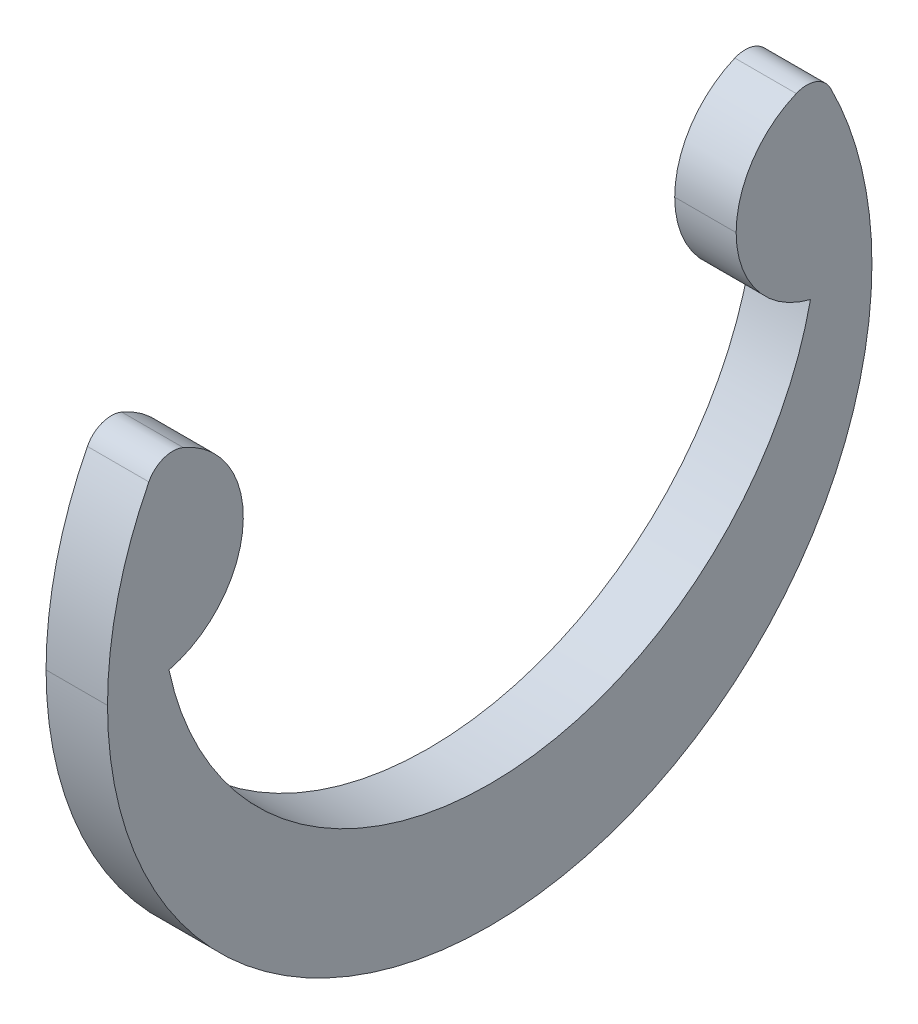
ISO-10303-21;
HEADER;
FILE_DESCRIPTION(('STEP AP214'),'2;1');
FILE_NAME('part.step','',(''),(''),'','','');
FILE_SCHEMA(('AUTOMOTIVE_DESIGN { 1 0 10303 214 1 1 1 1 }'));
ENDSEC;
DATA;
#1=APPLICATION_CONTEXT('core data for automotive mechanical design processes');
#2=APPLICATION_PROTOCOL_DEFINITION('international standard','automotive_design',2000,#1);
#3=PRODUCT_CONTEXT('',#1,'mechanical');
#4=PRODUCT('Part','Part','',(#3));
#5=PRODUCT_RELATED_PRODUCT_CATEGORY('part','',(#4));
#6=PRODUCT_DEFINITION_FORMATION('','',#4);
#7=PRODUCT_DEFINITION_CONTEXT('part definition',#1,'design');
#8=PRODUCT_DEFINITION('design','',#6,#7);
#9=PRODUCT_DEFINITION_SHAPE('','',#8);
#10=(LENGTH_UNIT() NAMED_UNIT(*) SI_UNIT(.MILLI.,.METRE.));
#11=(NAMED_UNIT(*) PLANE_ANGLE_UNIT() SI_UNIT($,.RADIAN.));
#12=(NAMED_UNIT(*) SI_UNIT($,.STERADIAN.) SOLID_ANGLE_UNIT());
#13=UNCERTAINTY_MEASURE_WITH_UNIT(LENGTH_MEASURE(1.E-05),#10,'distance_accuracy_value','');
#14=(GEOMETRIC_REPRESENTATION_CONTEXT(3) GLOBAL_UNCERTAINTY_ASSIGNED_CONTEXT((#13)) GLOBAL_UNIT_ASSIGNED_CONTEXT((#10,
#11,#12)) REPRESENTATION_CONTEXT('',''));
#15=CARTESIAN_POINT('',(0.,0.,0.));
#16=DIRECTION('',(0.,0.,1.));
#17=DIRECTION('',(1.,0.,0.));
#18=AXIS2_PLACEMENT_3D('',#15,#16,#17);
#19=CARTESIAN_POINT('',(0.3175,0.982787689221727,-3.55926968931105));
#20=DIRECTION('',(-1.,0.,0.));
#21=DIRECTION('',(0.,0.,1.));
#22=AXIS2_PLACEMENT_3D('',#19,#20,#21);
#23=CYLINDRICAL_SURFACE('',#22,1.01276155881603);
#24=CARTESIAN_POINT('',(0.3175,0.982787689221727,-3.55926968931105));
#25=DIRECTION('',(1.,0.,0.));
#26=DIRECTION('',(0.,0.,1.));
#27=AXIS2_PLACEMENT_3D('',#24,#25,#26);
#28=CIRCLE('',#27,1.01276155881603);
#29=CARTESIAN_POINT('',(0.3175,0.982787689221727,-2.54650813049501));
#30=VERTEX_POINT('',#29);
#31=CARTESIAN_POINT('',(0.3175,0.,-3.3147));
#32=VERTEX_POINT('',#31);
#33=EDGE_CURVE('E41',#30,#32,#28,.T.);
#34=ORIENTED_EDGE('',*,*,#33,.F.);
#35=DIRECTION('',(-1.,0.,0.));
#36=VECTOR('',#35,1.);
#37=CARTESIAN_POINT('',(0.3175,0.982787689221727,-2.54650813049501));
#38=LINE('',#37,#36);
#39=CARTESIAN_POINT('',(-0.3175,0.982787689221727,-2.54650813049501));
#40=VERTEX_POINT('',#39);
#41=EDGE_CURVE('E11',#30,#40,#38,.T.);
#42=ORIENTED_EDGE('',*,*,#41,.T.);
#43=CARTESIAN_POINT('',(-0.3175,0.982787689221727,-3.55926968931105));
#44=DIRECTION('',(1.,0.,0.));
#45=DIRECTION('',(0.,0.,1.));
#46=AXIS2_PLACEMENT_3D('',#43,#44,#45);
#47=CIRCLE('',#46,1.01276155881603);
#48=CARTESIAN_POINT('',(-0.3175,0.,-3.3147));
#49=VERTEX_POINT('',#48);
#50=EDGE_CURVE('E27',#40,#49,#47,.T.);
#51=ORIENTED_EDGE('',*,*,#50,.T.);
#52=DIRECTION('',(-1.,0.,0.));
#53=VECTOR('',#52,1.);
#54=CARTESIAN_POINT('',(0.3175,0.,-3.3147));
#55=LINE('',#54,#53);
#56=EDGE_CURVE('E143',#32,#49,#55,.T.);
#57=ORIENTED_EDGE('',*,*,#56,.F.);
#58=EDGE_LOOP('',(#34,#42,#51,#57));
#59=FACE_BOUND('',#58,.T.);
#60=ADVANCED_FACE('F16',(#59),#23,.T.);
#61=CARTESIAN_POINT('',(0.3175,0.,0.));
#62=DIRECTION('',(-1.,0.,0.));
#63=DIRECTION('',(0.,0.,1.));
#64=AXIS2_PLACEMENT_3D('',#61,#62,#63);
#65=CYLINDRICAL_SURFACE('',#64,3.9497);
#66=CARTESIAN_POINT('',(0.3175,0.,0.));
#67=DIRECTION('',(1.,0.,0.));
#68=DIRECTION('',(0.,0.,1.));
#69=AXIS2_PLACEMENT_3D('',#66,#67,#68);
#70=CIRCLE('',#69,3.9497);
#71=CARTESIAN_POINT('',(0.3175,0.,-3.9497));
#72=VERTEX_POINT('',#71);
#73=CARTESIAN_POINT('',(0.3175,1.78646666666667,-3.52259377999918));
#74=VERTEX_POINT('',#73);
#75=EDGE_CURVE('E188',#72,#74,#70,.T.);
#76=ORIENTED_EDGE('',*,*,#75,.F.);
#77=DIRECTION('',(-1.,0.,0.));
#78=VECTOR('',#77,1.);
#79=CARTESIAN_POINT('',(0.3175,0.,-3.9497));
#80=LINE('',#79,#78);
#81=CARTESIAN_POINT('',(-0.3175,0.,-3.9497));
#82=VERTEX_POINT('',#81);
#83=EDGE_CURVE('E180',#72,#82,#80,.T.);
#84=ORIENTED_EDGE('',*,*,#83,.T.);
#85=CARTESIAN_POINT('',(-0.3175,0.,0.));
#86=DIRECTION('',(1.,0.,0.));
#87=DIRECTION('',(0.,0.,1.));
#88=AXIS2_PLACEMENT_3D('',#85,#86,#87);
#89=CIRCLE('',#88,3.9497);
#90=CARTESIAN_POINT('',(-0.3175,1.78646666666667,-3.52259377999918));
#91=VERTEX_POINT('',#90);
#92=EDGE_CURVE('E103',#82,#91,#89,.T.);
#93=ORIENTED_EDGE('',*,*,#92,.T.);
#94=DIRECTION('',(-1.,0.,0.));
#95=VECTOR('',#94,1.);
#96=CARTESIAN_POINT('',(0.3175,1.78646666666667,-3.52259377999918));
#97=LINE('',#96,#95);
#98=EDGE_CURVE('E91',#74,#91,#97,.T.);
#99=ORIENTED_EDGE('',*,*,#98,.F.);
#100=EDGE_LOOP('',(#76,#84,#93,#99));
#101=FACE_BOUND('',#100,.T.);
#102=ADVANCED_FACE('F246',(#101),#65,.T.);
#103=CARTESIAN_POINT('',(0.3175,0.,0.));
#104=DIRECTION('',(-1.,0.,0.));
#105=DIRECTION('',(0.,0.,1.));
#106=AXIS2_PLACEMENT_3D('',#103,#104,#105);
#107=CYLINDRICAL_SURFACE('',#106,3.9497);
#108=ORIENTED_EDGE('',*,*,#83,.F.);
#109=CARTESIAN_POINT('',(0.3175,0.,0.));
#110=DIRECTION('',(1.,0.,0.));
#111=DIRECTION('',(0.,0.,1.));
#112=AXIS2_PLACEMENT_3D('',#109,#110,#111);
#113=CIRCLE('',#112,3.9497);
#114=CARTESIAN_POINT('',(0.3175,0.,3.9497));
#115=VERTEX_POINT('',#114);
#116=EDGE_CURVE('E233',#115,#72,#113,.T.);
#117=ORIENTED_EDGE('',*,*,#116,.F.);
#118=DIRECTION('',(-1.,0.,0.));
#119=VECTOR('',#118,1.);
#120=CARTESIAN_POINT('',(0.3175,0.,3.9497));
#121=LINE('',#120,#119);
#122=CARTESIAN_POINT('',(-0.3175,0.,3.9497));
#123=VERTEX_POINT('',#122);
#124=EDGE_CURVE('E171',#115,#123,#121,.T.);
#125=ORIENTED_EDGE('',*,*,#124,.T.);
#126=CARTESIAN_POINT('',(-0.3175,0.,0.));
#127=DIRECTION('',(1.,0.,0.));
#128=DIRECTION('',(0.,0.,1.));
#129=AXIS2_PLACEMENT_3D('',#126,#127,#128);
#130=CIRCLE('',#129,3.9497);
#131=EDGE_CURVE('E114',#123,#82,#130,.T.);
#132=ORIENTED_EDGE('',*,*,#131,.T.);
#133=EDGE_LOOP('',(#108,#117,#125,#132));
#134=FACE_BOUND('',#133,.T.);
#135=ADVANCED_FACE('F244',(#134),#107,.T.);
#136=CARTESIAN_POINT('',(0.3175,0.982787689221727,3.55926968931105));
#137=DIRECTION('',(-1.,0.,0.));
#138=DIRECTION('',(0.,0.,1.));
#139=AXIS2_PLACEMENT_3D('',#136,#137,#138);
#140=CYLINDRICAL_SURFACE('',#139,1.01276155881603);
#141=CARTESIAN_POINT('',(-0.3175,0.982787689221727,3.55926968931105));
#142=DIRECTION('',(1.,0.,0.));
#143=DIRECTION('',(0.,0.,1.));
#144=AXIS2_PLACEMENT_3D('',#141,#142,#143);
#145=CIRCLE('',#144,1.01276155881603);
#146=CARTESIAN_POINT('',(-0.3175,0.,3.3147));
#147=VERTEX_POINT('',#146);
#148=CARTESIAN_POINT('',(-0.3175,1.91687954310492,3.16791513967025));
#149=VERTEX_POINT('',#148);
#150=EDGE_CURVE('E153',#147,#149,#145,.T.);
#151=ORIENTED_EDGE('',*,*,#150,.T.);
#152=DIRECTION('',(-1.,0.,0.));
#153=VECTOR('',#152,1.);
#154=CARTESIAN_POINT('',(0.3175,1.91687954310492,3.16791513967025));
#155=LINE('',#154,#153);
#156=CARTESIAN_POINT('',(0.3175,1.91687954310492,3.16791513967025));
#157=VERTEX_POINT('',#156);
#158=EDGE_CURVE('E128',#157,#149,#155,.T.);
#159=ORIENTED_EDGE('',*,*,#158,.F.);
#160=CARTESIAN_POINT('',(0.3175,0.982787689221727,3.55926968931105));
#161=DIRECTION('',(1.,0.,0.));
#162=DIRECTION('',(0.,0.,1.));
#163=AXIS2_PLACEMENT_3D('',#160,#161,#162);
#164=CIRCLE('',#163,1.01276155881603);
#165=CARTESIAN_POINT('',(0.3175,0.,3.3147));
#166=VERTEX_POINT('',#165);
#167=EDGE_CURVE('E135',#166,#157,#164,.T.);
#168=ORIENTED_EDGE('',*,*,#167,.F.);
#169=DIRECTION('',(-1.,0.,0.));
#170=VECTOR('',#169,1.);
#171=CARTESIAN_POINT('',(0.3175,0.,3.3147));
#172=LINE('',#171,#170);
#173=EDGE_CURVE('E138',#166,#147,#172,.T.);
#174=ORIENTED_EDGE('',*,*,#173,.T.);
#175=EDGE_LOOP('',(#151,#159,#168,#174));
#176=FACE_BOUND('',#175,.T.);
#177=ADVANCED_FACE('F137',(#176),#140,.T.);
#178=CARTESIAN_POINT('',(0.3175,1.66096845654136,3.27513368312913));
#179=DIRECTION('',(-1.,0.,0.));
#180=DIRECTION('',(0.,0.,1.));
#181=AXIS2_PLACEMENT_3D('',#178,#179,#180);
#182=CYLINDRICAL_SURFACE('',#181,0.277464052243862);
#183=CARTESIAN_POINT('',(-0.3175,1.66096845654136,3.27513368312913));
#184=DIRECTION('',(1.,0.,0.));
#185=DIRECTION('',(0.,0.,1.));
#186=AXIS2_PLACEMENT_3D('',#183,#184,#185);
#187=CIRCLE('',#186,0.277464052243862);
#188=CARTESIAN_POINT('',(-0.3175,1.78646666666667,3.52259377999918));
#189=VERTEX_POINT('',#188);
#190=EDGE_CURVE('E154',#149,#189,#187,.T.);
#191=ORIENTED_EDGE('',*,*,#190,.T.);
#192=DIRECTION('',(-1.,0.,0.));
#193=VECTOR('',#192,1.);
#194=CARTESIAN_POINT('',(0.3175,1.78646666666667,3.52259377999918));
#195=LINE('',#194,#193);
#196=CARTESIAN_POINT('',(0.3175,1.78646666666667,3.52259377999918));
#197=VERTEX_POINT('',#196);
#198=EDGE_CURVE('E20',#197,#189,#195,.T.);
#199=ORIENTED_EDGE('',*,*,#198,.F.);
#200=CARTESIAN_POINT('',(0.3175,1.66096845654136,3.27513368312913));
#201=DIRECTION('',(1.,0.,0.));
#202=DIRECTION('',(0.,0.,1.));
#203=AXIS2_PLACEMENT_3D('',#200,#201,#202);
#204=CIRCLE('',#203,0.277464052243862);
#205=EDGE_CURVE('E144',#157,#197,#204,.T.);
#206=ORIENTED_EDGE('',*,*,#205,.F.);
#207=ORIENTED_EDGE('',*,*,#158,.T.);
#208=EDGE_LOOP('',(#191,#199,#206,#207));
#209=FACE_BOUND('',#208,.T.);
#210=ADVANCED_FACE('F215',(#209),#182,.T.);
#211=CARTESIAN_POINT('',(0.3175,0.,0.));
#212=DIRECTION('',(-1.,0.,0.));
#213=DIRECTION('',(0.,0.,1.));
#214=AXIS2_PLACEMENT_3D('',#211,#212,#213);
#215=CYLINDRICAL_SURFACE('',#214,3.9497);
#216=ORIENTED_EDGE('',*,*,#124,.F.);
#217=CARTESIAN_POINT('',(0.3175,0.,0.));
#218=DIRECTION('',(1.,0.,0.));
#219=DIRECTION('',(0.,0.,1.));
#220=AXIS2_PLACEMENT_3D('',#217,#218,#219);
#221=CIRCLE('',#220,3.9497);
#222=EDGE_CURVE('E175',#197,#115,#221,.T.);
#223=ORIENTED_EDGE('',*,*,#222,.F.);
#224=ORIENTED_EDGE('',*,*,#198,.T.);
#225=CARTESIAN_POINT('',(-0.3175,0.,0.));
#226=DIRECTION('',(1.,0.,0.));
#227=DIRECTION('',(0.,0.,1.));
#228=AXIS2_PLACEMENT_3D('',#225,#226,#227);
#229=CIRCLE('',#228,3.9497);
#230=EDGE_CURVE('E199',#189,#123,#229,.T.);
#231=ORIENTED_EDGE('',*,*,#230,.T.);
#232=EDGE_LOOP('',(#216,#223,#224,#231));
#233=FACE_BOUND('',#232,.T.);
#234=ADVANCED_FACE('F222',(#233),#215,.T.);
#235=CARTESIAN_POINT('',(0.3175,1.66096845654136,-3.27513368312913));
#236=DIRECTION('',(-1.,0.,0.));
#237=DIRECTION('',(0.,0.,1.));
#238=AXIS2_PLACEMENT_3D('',#235,#236,#237);
#239=CYLINDRICAL_SURFACE('',#238,0.277464052243862);
#240=CARTESIAN_POINT('',(-0.3175,1.66096845654136,-3.27513368312913));
#241=DIRECTION('',(1.,0.,0.));
#242=DIRECTION('',(0.,0.,-1.));
#243=AXIS2_PLACEMENT_3D('',#240,#241,#242);
#244=CIRCLE('',#243,0.277464052243862);
#245=CARTESIAN_POINT('',(-0.3175,1.91687954310492,-3.16791513967025));
#246=VERTEX_POINT('',#245);
#247=EDGE_CURVE('E169',#91,#246,#244,.T.);
#248=ORIENTED_EDGE('',*,*,#247,.T.);
#249=DIRECTION('',(-1.,0.,0.));
#250=VECTOR('',#249,1.);
#251=CARTESIAN_POINT('',(0.3175,1.91687954310492,-3.16791513967025));
#252=LINE('',#251,#250);
#253=CARTESIAN_POINT('',(0.3175,1.91687954310492,-3.16791513967025));
#254=VERTEX_POINT('',#253);
#255=EDGE_CURVE('E182',#254,#246,#252,.T.);
#256=ORIENTED_EDGE('',*,*,#255,.F.);
#257=CARTESIAN_POINT('',(0.3175,1.66096845654136,-3.27513368312913));
#258=DIRECTION('',(1.,0.,0.));
#259=DIRECTION('',(0.,0.,-1.));
#260=AXIS2_PLACEMENT_3D('',#257,#258,#259);
#261=CIRCLE('',#260,0.277464052243862);
#262=EDGE_CURVE('E185',#74,#254,#261,.T.);
#263=ORIENTED_EDGE('',*,*,#262,.F.);
#264=ORIENTED_EDGE('',*,*,#98,.T.);
#265=EDGE_LOOP('',(#248,#256,#263,#264));
#266=FACE_BOUND('',#265,.T.);
#267=ADVANCED_FACE('F248',(#266),#239,.T.);
#268=CARTESIAN_POINT('',(0.3175,0.982787689221727,-3.55926968931105));
#269=DIRECTION('',(-1.,0.,0.));
#270=DIRECTION('',(0.,0.,1.));
#271=AXIS2_PLACEMENT_3D('',#268,#269,#270);
#272=CYLINDRICAL_SURFACE('',#271,1.01276155881603);
#273=ORIENTED_EDGE('',*,*,#41,.F.);
#274=CARTESIAN_POINT('',(0.3175,0.982787689221727,-3.55926968931105));
#275=DIRECTION('',(1.,0.,0.));
#276=DIRECTION('',(0.,0.,1.));
#277=AXIS2_PLACEMENT_3D('',#274,#275,#276);
#278=CIRCLE('',#277,1.01276155881603);
#279=EDGE_CURVE('E165',#254,#30,#278,.T.);
#280=ORIENTED_EDGE('',*,*,#279,.F.);
#281=ORIENTED_EDGE('',*,*,#255,.T.);
#282=CARTESIAN_POINT('',(-0.3175,0.982787689221727,-3.55926968931105));
#283=DIRECTION('',(1.,0.,0.));
#284=DIRECTION('',(0.,0.,1.));
#285=AXIS2_PLACEMENT_3D('',#282,#283,#284);
#286=CIRCLE('',#285,1.01276155881603);
#287=EDGE_CURVE('E178',#246,#40,#286,.T.);
#288=ORIENTED_EDGE('',*,*,#287,.T.);
#289=EDGE_LOOP('',(#273,#280,#281,#288));
#290=FACE_BOUND('',#289,.T.);
#291=ADVANCED_FACE('F251',(#290),#272,.T.);
#292=CARTESIAN_POINT('',(0.3175,0.710236966824645,0.));
#293=DIRECTION('',(-1.,0.,0.));
#294=DIRECTION('',(0.,0.,1.));
#295=AXIS2_PLACEMENT_3D('',#292,#293,#294);
#296=CYLINDRICAL_SURFACE('',#295,3.38993696682465);
#297=CARTESIAN_POINT('',(-0.3175,0.710236966824645,0.));
#298=DIRECTION('',(-1.,0.,0.));
#299=DIRECTION('',(0.,0.,-1.));
#300=AXIS2_PLACEMENT_3D('',#297,#298,#299);
#301=CIRCLE('',#300,3.38993696682465);
#302=EDGE_CURVE('E151',#49,#147,#301,.T.);
#303=ORIENTED_EDGE('',*,*,#302,.T.);
#304=ORIENTED_EDGE('',*,*,#173,.F.);
#305=CARTESIAN_POINT('',(0.3175,0.710236966824645,0.));
#306=DIRECTION('',(-1.,0.,0.));
#307=DIRECTION('',(0.,0.,-1.));
#308=AXIS2_PLACEMENT_3D('',#305,#306,#307);
#309=CIRCLE('',#308,3.38993696682465);
#310=EDGE_CURVE('E149',#32,#166,#309,.T.);
#311=ORIENTED_EDGE('',*,*,#310,.F.);
#312=ORIENTED_EDGE('',*,*,#56,.T.);
#313=EDGE_LOOP('',(#303,#304,#311,#312));
#314=FACE_BOUND('',#313,.T.);
#315=ADVANCED_FACE('F18',(#314),#296,.F.);
#316=CARTESIAN_POINT('',(0.3175,0.846512328023186,1.77963484465553));
#317=DIRECTION('',(-1.,0.,0.));
#318=DIRECTION('',(0.,0.,1.));
#319=AXIS2_PLACEMENT_3D('',#316,#317,#318);
#320=PLANE('',#319);
#321=ORIENTED_EDGE('',*,*,#167,.T.);
#322=ORIENTED_EDGE('',*,*,#205,.T.);
#323=ORIENTED_EDGE('',*,*,#222,.T.);
#324=ORIENTED_EDGE('',*,*,#116,.T.);
#325=ORIENTED_EDGE('',*,*,#75,.T.);
#326=ORIENTED_EDGE('',*,*,#262,.T.);
#327=ORIENTED_EDGE('',*,*,#279,.T.);
#328=ORIENTED_EDGE('',*,*,#33,.T.);
#329=ORIENTED_EDGE('',*,*,#310,.T.);
#330=EDGE_LOOP('',(#321,#322,#323,#324,#325,#326,#327,#328,#329));
#331=FACE_BOUND('',#330,.T.);
#332=ADVANCED_FACE('F156',(#331),#320,.F.);
#333=CARTESIAN_POINT('',(-0.3175,0.846512328023186,1.77963484465553));
#334=DIRECTION('',(-1.,0.,0.));
#335=DIRECTION('',(0.,0.,1.));
#336=AXIS2_PLACEMENT_3D('',#333,#334,#335);
#337=PLANE('',#336);
#338=ORIENTED_EDGE('',*,*,#150,.F.);
#339=ORIENTED_EDGE('',*,*,#302,.F.);
#340=ORIENTED_EDGE('',*,*,#50,.F.);
#341=ORIENTED_EDGE('',*,*,#287,.F.);
#342=ORIENTED_EDGE('',*,*,#247,.F.);
#343=ORIENTED_EDGE('',*,*,#92,.F.);
#344=ORIENTED_EDGE('',*,*,#131,.F.);
#345=ORIENTED_EDGE('',*,*,#230,.F.);
#346=ORIENTED_EDGE('',*,*,#190,.F.);
#347=EDGE_LOOP('',(#338,#339,#340,#341,#342,#343,#344,#345,#346));
#348=FACE_BOUND('',#347,.T.);
#349=ADVANCED_FACE('F213',(#348),#337,.T.);
#350=CLOSED_SHELL('',(#60,#102,#135,#177,#210,#234,#267,#291,#315,#332,#349));
#351=MANIFOLD_SOLID_BREP('B1',#350);
#352=ADVANCED_BREP_SHAPE_REPRESENTATION('',(#18,#351),#14);
#353=SHAPE_DEFINITION_REPRESENTATION(#9,#352);
ENDSEC;
END-ISO-10303-21;
